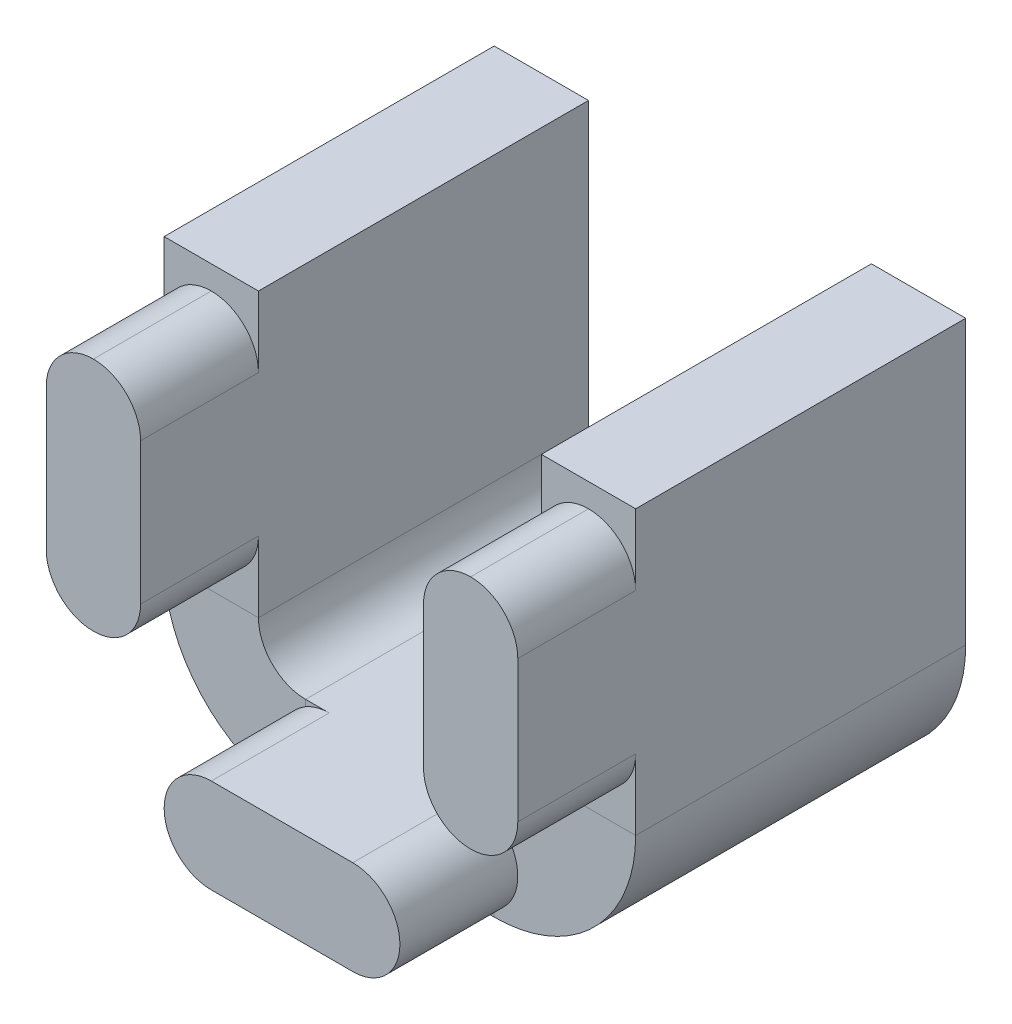
ISO-10303-21;
HEADER;
FILE_DESCRIPTION(('STEP AP214'),'2;1');
FILE_NAME('part.step','',(''),(''),'','','');
FILE_SCHEMA(('AUTOMOTIVE_DESIGN { 1 0 10303 214 1 1 1 1 }'));
ENDSEC;
DATA;
#1=APPLICATION_CONTEXT('core data for automotive mechanical design processes');
#2=APPLICATION_PROTOCOL_DEFINITION('international standard','automotive_design',2000,#1);
#3=PRODUCT_CONTEXT('',#1,'mechanical');
#4=PRODUCT('Part','Part','',(#3));
#5=PRODUCT_RELATED_PRODUCT_CATEGORY('part','',(#4));
#6=PRODUCT_DEFINITION_FORMATION('','',#4);
#7=PRODUCT_DEFINITION_CONTEXT('part definition',#1,'design');
#8=PRODUCT_DEFINITION('design','',#6,#7);
#9=PRODUCT_DEFINITION_SHAPE('','',#8);
#10=(LENGTH_UNIT() NAMED_UNIT(*) SI_UNIT(.MILLI.,.METRE.));
#11=(NAMED_UNIT(*) PLANE_ANGLE_UNIT() SI_UNIT($,.RADIAN.));
#12=(NAMED_UNIT(*) SI_UNIT($,.STERADIAN.) SOLID_ANGLE_UNIT());
#13=UNCERTAINTY_MEASURE_WITH_UNIT(LENGTH_MEASURE(1.E-05),#10,'distance_accuracy_value','');
#14=(GEOMETRIC_REPRESENTATION_CONTEXT(3) GLOBAL_UNCERTAINTY_ASSIGNED_CONTEXT((#13)) GLOBAL_UNIT_ASSIGNED_CONTEXT((#10,
#11,#12)) REPRESENTATION_CONTEXT('',''));
#15=CARTESIAN_POINT('',(0.,0.,0.));
#16=DIRECTION('',(0.,0.,1.));
#17=DIRECTION('',(1.,0.,0.));
#18=AXIS2_PLACEMENT_3D('',#15,#16,#17);
#19=CARTESIAN_POINT('',(-3.,0.,3.5));
#20=DIRECTION('',(0.,-1.,0.));
#21=DIRECTION('',(0.,0.,-1.));
#22=AXIS2_PLACEMENT_3D('',#19,#20,#21);
#23=PLANE('',#22);
#24=DIRECTION('',(0.,0.,-1.));
#25=VECTOR('',#24,1.);
#26=CARTESIAN_POINT('',(-2.00000000000002,0.,-3.5));
#27=LINE('',#26,#25);
#28=CARTESIAN_POINT('',(-2.00000000000002,0.,3.5));
#29=VERTEX_POINT('',#28);
#30=CARTESIAN_POINT('',(-2.00000000000002,0.,-3.5));
#31=VERTEX_POINT('',#30);
#32=EDGE_CURVE('E331',#29,#31,#27,.T.);
#33=ORIENTED_EDGE('',*,*,#32,.F.);
#34=DIRECTION('',(-1.,0.,0.));
#35=VECTOR('',#34,1.);
#36=CARTESIAN_POINT('',(-3.,0.,3.5));
#37=LINE('',#36,#35);
#38=CARTESIAN_POINT('',(-1.5,0.,3.5));
#39=VERTEX_POINT('',#38);
#40=EDGE_CURVE('E327',#39,#29,#37,.T.);
#41=ORIENTED_EDGE('',*,*,#40,.F.);
#42=DIRECTION('',(0.,0.,-1.));
#43=VECTOR('',#42,1.);
#44=CARTESIAN_POINT('',(-1.5,0.,6.));
#45=LINE('',#44,#43);
#46=CARTESIAN_POINT('',(-1.5,0.,6.));
#47=VERTEX_POINT('',#46);
#48=EDGE_CURVE('E665',#47,#39,#45,.T.);
#49=ORIENTED_EDGE('',*,*,#48,.F.);
#50=DIRECTION('',(-1.,0.,0.));
#51=VECTOR('',#50,1.);
#52=CARTESIAN_POINT('',(1.5,0.,6.));
#53=LINE('',#52,#51);
#54=CARTESIAN_POINT('',(1.5,0.,6.));
#55=VERTEX_POINT('',#54);
#56=EDGE_CURVE('E260',#55,#47,#53,.T.);
#57=ORIENTED_EDGE('',*,*,#56,.F.);
#58=DIRECTION('',(0.,0.,-1.));
#59=VECTOR('',#58,1.);
#60=CARTESIAN_POINT('',(1.5,0.,6.));
#61=LINE('',#60,#59);
#62=CARTESIAN_POINT('',(1.5,0.,3.5));
#63=VERTEX_POINT('',#62);
#64=EDGE_CURVE('E272',#55,#63,#61,.T.);
#65=ORIENTED_EDGE('',*,*,#64,.T.);
#66=CARTESIAN_POINT('',(2.00000000000002,0.,3.5));
#67=VERTEX_POINT('',#66);
#68=EDGE_CURVE('E328',#67,#63,#37,.T.);
#69=ORIENTED_EDGE('',*,*,#68,.F.);
#70=DIRECTION('',(0.,0.,1.));
#71=VECTOR('',#70,1.);
#72=CARTESIAN_POINT('',(2.00000000000002,0.,3.5));
#73=LINE('',#72,#71);
#74=CARTESIAN_POINT('',(2.00000000000002,0.,-3.5));
#75=VERTEX_POINT('',#74);
#76=EDGE_CURVE('E347',#75,#67,#73,.T.);
#77=ORIENTED_EDGE('',*,*,#76,.F.);
#78=DIRECTION('',(-1.,0.,0.));
#79=VECTOR('',#78,1.);
#80=CARTESIAN_POINT('',(-3.,0.,-3.5));
#81=LINE('',#80,#79);
#82=EDGE_CURVE('E324',#75,#31,#81,.T.);
#83=ORIENTED_EDGE('',*,*,#82,.T.);
#84=EDGE_LOOP('',(#33,#41,#49,#57,#65,#69,#77,#83));
#85=FACE_BOUND('',#84,.T.);
#86=CARTESIAN_POINT('',(0.,0.,0.));
#87=DIRECTION('',(0.,-1.,0.));
#88=DIRECTION('',(0.,0.,-1.));
#89=AXIS2_PLACEMENT_3D('',#86,#87,#88);
#90=CIRCLE('',#89,1.75);
#91=CARTESIAN_POINT('',(0.,0.,-1.75));
#92=VERTEX_POINT('',#91);
#93=EDGE_CURVE('E12',#92,#92,#90,.F.);
#94=ORIENTED_EDGE('',*,*,#93,.F.);
#95=EDGE_LOOP('',(#94));
#96=FACE_BOUND('',#95,.T.);
#97=ADVANCED_FACE('F44',(#85,#96),#23,.F.);
#98=CARTESIAN_POINT('',(-3.,16.1245154965971,3.5));
#99=DIRECTION('',(0.,0.,1.));
#100=DIRECTION('',(1.,0.,0.));
#101=AXIS2_PLACEMENT_3D('',#98,#99,#100);
#102=PLANE('',#101);
#103=DIRECTION('',(1.,0.,0.));
#104=VECTOR('',#103,1.);
#105=CARTESIAN_POINT('',(-3.,-2.,3.5));
#106=LINE('',#105,#104);
#107=CARTESIAN_POINT('',(-1.5,-2.,3.5));
#108=VERTEX_POINT('',#107);
#109=CARTESIAN_POINT('',(-2.00000000000002,-2.,3.5));
#110=VERTEX_POINT('',#109);
#111=EDGE_CURVE('E318',#108,#110,#106,.F.);
#112=ORIENTED_EDGE('',*,*,#111,.F.);
#113=CARTESIAN_POINT('',(-1.5,-1.,3.5));
#114=DIRECTION('',(0.,0.,1.));
#115=DIRECTION('',(-1.,0.,0.));
#116=AXIS2_PLACEMENT_3D('',#113,#114,#115);
#117=CIRCLE('',#116,1.);
#118=CARTESIAN_POINT('',(-2.00000000000002,-1.86602540378443,3.5));
#119=VERTEX_POINT('',#118);
#120=EDGE_CURVE('E266',#119,#108,#117,.T.);
#121=ORIENTED_EDGE('',*,*,#120,.F.);
#122=DIRECTION('',(0.,-1.,0.));
#123=VECTOR('',#122,1.);
#124=CARTESIAN_POINT('',(-2.00000000000002,16.1245154965971,3.5));
#125=LINE('',#124,#123);
#126=EDGE_CURVE('E341',#119,#110,#125,.T.);
#127=ORIENTED_EDGE('',*,*,#126,.T.);
#128=EDGE_LOOP('',(#112,#121,#127));
#129=FACE_BOUND('',#128,.T.);
#130=ADVANCED_FACE('F566',(#129),#102,.T.);
#131=CARTESIAN_POINT('',(-2.00000000000002,-0.133974596215571,3.5));
#132=VERTEX_POINT('',#131);
#133=EDGE_CURVE('E342',#29,#132,#125,.T.);
#134=ORIENTED_EDGE('',*,*,#133,.T.);
#135=EDGE_CURVE('E60',#39,#132,#117,.T.);
#136=ORIENTED_EDGE('',*,*,#135,.F.);
#137=ORIENTED_EDGE('',*,*,#40,.T.);
#138=EDGE_LOOP('',(#134,#136,#137));
#139=FACE_BOUND('',#138,.T.);
#140=ADVANCED_FACE('F571',(#139),#102,.T.);
#141=DIRECTION('',(0.,-1.,0.));
#142=VECTOR('',#141,1.);
#143=CARTESIAN_POINT('',(2.00000000000002,16.1245154965971,3.5));
#144=LINE('',#143,#142);
#145=CARTESIAN_POINT('',(2.00000000000002,-1.86602540378443,3.5));
#146=VERTEX_POINT('',#145);
#147=CARTESIAN_POINT('',(2.00000000000002,-2.,3.5));
#148=VERTEX_POINT('',#147);
#149=EDGE_CURVE('E337',#146,#148,#144,.T.);
#150=ORIENTED_EDGE('',*,*,#149,.F.);
#151=CARTESIAN_POINT('',(1.5,-1.,3.5));
#152=DIRECTION('',(0.,0.,1.));
#153=DIRECTION('',(1.,0.,0.));
#154=AXIS2_PLACEMENT_3D('',#151,#152,#153);
#155=CIRCLE('',#154,1.);
#156=CARTESIAN_POINT('',(1.5,-2.,3.5));
#157=VERTEX_POINT('',#156);
#158=EDGE_CURVE('E262',#157,#146,#155,.T.);
#159=ORIENTED_EDGE('',*,*,#158,.F.);
#160=EDGE_CURVE('E319',#148,#157,#106,.F.);
#161=ORIENTED_EDGE('',*,*,#160,.F.);
#162=EDGE_LOOP('',(#150,#159,#161));
#163=FACE_BOUND('',#162,.T.);
#164=ADVANCED_FACE('F492',(#163),#102,.T.);
#165=ORIENTED_EDGE('',*,*,#68,.T.);
#166=CARTESIAN_POINT('',(2.00000000000002,-0.133974596215571,3.5));
#167=VERTEX_POINT('',#166);
#168=EDGE_CURVE('E670',#167,#63,#155,.T.);
#169=ORIENTED_EDGE('',*,*,#168,.F.);
#170=EDGE_CURVE('E338',#67,#167,#144,.T.);
#171=ORIENTED_EDGE('',*,*,#170,.F.);
#172=EDGE_LOOP('',(#165,#169,#171));
#173=FACE_BOUND('',#172,.T.);
#174=ADVANCED_FACE('F574',(#173),#102,.T.);
#175=CARTESIAN_POINT('',(2.00000000000002,0.999999999999983,3.5));
#176=DIRECTION('',(0.,0.,1.));
#177=DIRECTION('',(1.,0.,0.));
#178=AXIS2_PLACEMENT_3D('',#175,#176,#177);
#179=PLANE('',#178);
#180=ORIENTED_EDGE('',*,*,#170,.T.);
#181=CARTESIAN_POINT('',(1.5,-1.,3.5));
#182=DIRECTION('',(0.,0.,1.));
#183=DIRECTION('',(1.,0.,0.));
#184=AXIS2_PLACEMENT_3D('',#181,#182,#183);
#185=CIRCLE('',#184,1.);
#186=EDGE_CURVE('E53',#167,#146,#185,.F.);
#187=ORIENTED_EDGE('',*,*,#186,.T.);
#188=ORIENTED_EDGE('',*,*,#149,.T.);
#189=CARTESIAN_POINT('',(2.00000000000002,0.999999999999983,3.5));
#190=DIRECTION('',(0.,0.,-1.));
#191=DIRECTION('',(-1.,0.,0.));
#192=AXIS2_PLACEMENT_3D('',#189,#190,#191);
#193=CIRCLE('',#192,2.99999999999998);
#194=CARTESIAN_POINT('',(5.,0.999999999999984,3.5));
#195=VERTEX_POINT('',#194);
#196=EDGE_CURVE('E305',#195,#148,#193,.T.);
#197=ORIENTED_EDGE('',*,*,#196,.F.);
#198=DIRECTION('',(1.,0.,0.));
#199=VECTOR('',#198,1.);
#200=CARTESIAN_POINT('',(-15.4390889145858,0.999999999999982,3.5));
#201=LINE('',#200,#199);
#202=CARTESIAN_POINT('',(3.,0.999999999999981,3.5));
#203=VERTEX_POINT('',#202);
#204=EDGE_CURVE('E372',#203,#195,#201,.T.);
#205=ORIENTED_EDGE('',*,*,#204,.F.);
#206=CARTESIAN_POINT('',(2.00000000000002,0.999999999999983,3.5));
#207=DIRECTION('',(0.,0.,-1.));
#208=DIRECTION('',(-1.,0.,0.));
#209=AXIS2_PLACEMENT_3D('',#206,#207,#208);
#210=CIRCLE('',#209,0.999999999999983);
#211=EDGE_CURVE('E301',#203,#67,#210,.T.);
#212=ORIENTED_EDGE('',*,*,#211,.T.);
#213=EDGE_LOOP('',(#180,#187,#188,#197,#205,#212));
#214=FACE_BOUND('',#213,.T.);
#215=ADVANCED_FACE('F484',(#214),#179,.T.);
#216=CARTESIAN_POINT('',(-2.00000000000002,0.999999999999983,3.5));
#217=DIRECTION('',(0.,0.,1.));
#218=DIRECTION('',(1.,0.,0.));
#219=AXIS2_PLACEMENT_3D('',#216,#217,#218);
#220=PLANE('',#219);
#221=ORIENTED_EDGE('',*,*,#126,.F.);
#222=CARTESIAN_POINT('',(-1.5,-1.,3.5));
#223=DIRECTION('',(0.,0.,1.));
#224=DIRECTION('',(1.,0.,0.));
#225=AXIS2_PLACEMENT_3D('',#222,#223,#224);
#226=CIRCLE('',#225,1.);
#227=EDGE_CURVE('E478',#119,#132,#226,.F.);
#228=ORIENTED_EDGE('',*,*,#227,.T.);
#229=ORIENTED_EDGE('',*,*,#133,.F.);
#230=CARTESIAN_POINT('',(-2.00000000000002,0.999999999999983,3.5));
#231=DIRECTION('',(0.,0.,1.));
#232=DIRECTION('',(1.,0.,0.));
#233=AXIS2_PLACEMENT_3D('',#230,#231,#232);
#234=CIRCLE('',#233,0.999999999999983);
#235=CARTESIAN_POINT('',(-3.,0.999999999999983,3.5));
#236=VERTEX_POINT('',#235);
#237=EDGE_CURVE('E298',#29,#236,#234,.F.);
#238=ORIENTED_EDGE('',*,*,#237,.T.);
#239=DIRECTION('',(-1.,0.,0.));
#240=VECTOR('',#239,1.);
#241=CARTESIAN_POINT('',(15.4390889145858,0.999999999999982,3.5));
#242=LINE('',#241,#240);
#243=CARTESIAN_POINT('',(-5.,0.999999999999983,3.5));
#244=VERTEX_POINT('',#243);
#245=EDGE_CURVE('E356',#236,#244,#242,.T.);
#246=ORIENTED_EDGE('',*,*,#245,.T.);
#247=CARTESIAN_POINT('',(-2.00000000000002,0.999999999999983,3.5));
#248=DIRECTION('',(0.,0.,1.));
#249=DIRECTION('',(1.,0.,0.));
#250=AXIS2_PLACEMENT_3D('',#247,#248,#249);
#251=CIRCLE('',#250,2.99999999999998);
#252=EDGE_CURVE('E297',#110,#244,#251,.F.);
#253=ORIENTED_EDGE('',*,*,#252,.F.);
#254=EDGE_LOOP('',(#221,#228,#229,#238,#246,#253));
#255=FACE_BOUND('',#254,.T.);
#256=ADVANCED_FACE('F661',(#255),#220,.T.);
#257=CARTESIAN_POINT('',(-15.4390889145858,0.,3.5));
#258=DIRECTION('',(0.,0.,1.));
#259=DIRECTION('',(0.,1.,0.));
#260=AXIS2_PLACEMENT_3D('',#257,#258,#259);
#261=PLANE('',#260);
#262=CARTESIAN_POINT('',(4.,2.5,3.5));
#263=DIRECTION('',(0.,0.,1.));
#264=DIRECTION('',(1.,0.,0.));
#265=AXIS2_PLACEMENT_3D('',#262,#263,#264);
#266=CIRCLE('',#265,1.);
#267=CARTESIAN_POINT('',(5.,2.5,3.5));
#268=VERTEX_POINT('',#267);
#269=CARTESIAN_POINT('',(4.,1.5,3.5));
#270=VERTEX_POINT('',#269);
#271=EDGE_CURVE('E68',#268,#270,#266,.F.);
#272=ORIENTED_EDGE('',*,*,#271,.T.);
#273=CARTESIAN_POINT('',(4.,2.5,3.5));
#274=DIRECTION('',(0.,0.,1.));
#275=DIRECTION('',(1.,0.,0.));
#276=AXIS2_PLACEMENT_3D('',#273,#274,#275);
#277=CIRCLE('',#276,1.);
#278=CARTESIAN_POINT('',(3.,2.5,3.5));
#279=VERTEX_POINT('',#278);
#280=EDGE_CURVE('E473',#270,#279,#277,.F.);
#281=ORIENTED_EDGE('',*,*,#280,.T.);
#282=DIRECTION('',(0.,-1.,0.));
#283=VECTOR('',#282,1.);
#284=CARTESIAN_POINT('',(3.,0.,3.5));
#285=LINE('',#284,#283);
#286=EDGE_CURVE('E371',#279,#203,#285,.T.);
#287=ORIENTED_EDGE('',*,*,#286,.T.);
#288=ORIENTED_EDGE('',*,*,#204,.T.);
#289=DIRECTION('',(0.,1.,0.));
#290=VECTOR('',#289,1.);
#291=CARTESIAN_POINT('',(5.,0.,3.5));
#292=LINE('',#291,#290);
#293=EDGE_CURVE('E368',#268,#195,#292,.F.);
#294=ORIENTED_EDGE('',*,*,#293,.F.);
#295=EDGE_LOOP('',(#272,#281,#287,#288,#294));
#296=FACE_BOUND('',#295,.T.);
#297=ADVANCED_FACE('F521',(#296),#261,.T.);
#298=CARTESIAN_POINT('',(15.4390889145858,0.,3.5));
#299=DIRECTION('',(0.,0.,1.));
#300=DIRECTION('',(0.,-1.,0.));
#301=AXIS2_PLACEMENT_3D('',#298,#299,#300);
#302=PLANE('',#301);
#303=DIRECTION('',(0.,-1.,0.));
#304=VECTOR('',#303,1.);
#305=CARTESIAN_POINT('',(-5.,0.,3.5));
#306=LINE('',#305,#304);
#307=CARTESIAN_POINT('',(-5.,7.,3.5));
#308=VERTEX_POINT('',#307);
#309=CARTESIAN_POINT('',(-5.,5.5,3.5));
#310=VERTEX_POINT('',#309);
#311=EDGE_CURVE('E396',#308,#310,#306,.T.);
#312=ORIENTED_EDGE('',*,*,#311,.T.);
#313=CARTESIAN_POINT('',(-4.,5.5,3.5));
#314=DIRECTION('',(0.,0.,1.));
#315=DIRECTION('',(1.,0.,0.));
#316=AXIS2_PLACEMENT_3D('',#313,#314,#315);
#317=CIRCLE('',#316,1.);
#318=CARTESIAN_POINT('',(-4.,6.5,3.5));
#319=VERTEX_POINT('',#318);
#320=EDGE_CURVE('E446',#310,#319,#317,.F.);
#321=ORIENTED_EDGE('',*,*,#320,.T.);
#322=CARTESIAN_POINT('',(-4.,5.5,3.5));
#323=DIRECTION('',(0.,0.,1.));
#324=DIRECTION('',(1.,0.,0.));
#325=AXIS2_PLACEMENT_3D('',#322,#323,#324);
#326=CIRCLE('',#325,1.);
#327=CARTESIAN_POINT('',(-3.,5.5,3.5));
#328=VERTEX_POINT('',#327);
#329=EDGE_CURVE('E443',#319,#328,#326,.F.);
#330=ORIENTED_EDGE('',*,*,#329,.T.);
#331=DIRECTION('',(0.,-1.,0.));
#332=VECTOR('',#331,1.);
#333=CARTESIAN_POINT('',(-3.,0.,3.5));
#334=LINE('',#333,#332);
#335=CARTESIAN_POINT('',(-3.,7.,3.5));
#336=VERTEX_POINT('',#335);
#337=EDGE_CURVE('E393',#336,#328,#334,.T.);
#338=ORIENTED_EDGE('',*,*,#337,.F.);
#339=DIRECTION('',(-1.,0.,0.));
#340=VECTOR('',#339,1.);
#341=CARTESIAN_POINT('',(15.4390889145858,7.,3.5));
#342=LINE('',#341,#340);
#343=EDGE_CURVE('E399',#336,#308,#342,.T.);
#344=ORIENTED_EDGE('',*,*,#343,.T.);
#345=EDGE_LOOP('',(#312,#321,#330,#338,#344));
#346=FACE_BOUND('',#345,.T.);
#347=ADVANCED_FACE('F609',(#346),#302,.T.);
#348=CARTESIAN_POINT('',(-3.,-2.,3.5));
#349=DIRECTION('',(0.,-1.,0.));
#350=DIRECTION('',(0.,0.,-1.));
#351=AXIS2_PLACEMENT_3D('',#348,#349,#350);
#352=PLANE('',#351);
#353=ORIENTED_EDGE('',*,*,#160,.T.);
#354=DIRECTION('',(0.,0.,-1.));
#355=VECTOR('',#354,1.);
#356=CARTESIAN_POINT('',(1.5,-2.,6.));
#357=LINE('',#356,#355);
#358=CARTESIAN_POINT('',(1.5,-2.,6.));
#359=VERTEX_POINT('',#358);
#360=EDGE_CURVE('E251',#359,#157,#357,.T.);
#361=ORIENTED_EDGE('',*,*,#360,.F.);
#362=DIRECTION('',(1.,0.,0.));
#363=VECTOR('',#362,1.);
#364=CARTESIAN_POINT('',(-1.5,-2.,6.));
#365=LINE('',#364,#363);
#366=CARTESIAN_POINT('',(-1.5,-2.,6.));
#367=VERTEX_POINT('',#366);
#368=EDGE_CURVE('E243',#367,#359,#365,.T.);
#369=ORIENTED_EDGE('',*,*,#368,.F.);
#370=DIRECTION('',(0.,0.,-1.));
#371=VECTOR('',#370,1.);
#372=CARTESIAN_POINT('',(-1.5,-2.,6.));
#373=LINE('',#372,#371);
#374=EDGE_CURVE('E249',#367,#108,#373,.T.);
#375=ORIENTED_EDGE('',*,*,#374,.T.);
#376=ORIENTED_EDGE('',*,*,#111,.T.);
#377=DIRECTION('',(0.,0.,-1.));
#378=VECTOR('',#377,1.);
#379=CARTESIAN_POINT('',(-2.00000000000002,-2.,-3.5));
#380=LINE('',#379,#378);
#381=CARTESIAN_POINT('',(-2.00000000000002,-2.,-3.5));
#382=VERTEX_POINT('',#381);
#383=EDGE_CURVE('E321',#110,#382,#380,.T.);
#384=ORIENTED_EDGE('',*,*,#383,.T.);
#385=DIRECTION('',(1.,0.,0.));
#386=VECTOR('',#385,1.);
#387=CARTESIAN_POINT('',(-3.,-2.,-3.5));
#388=LINE('',#387,#386);
#389=CARTESIAN_POINT('',(2.00000000000002,-2.,-3.5));
#390=VERTEX_POINT('',#389);
#391=EDGE_CURVE('E312',#390,#382,#388,.F.);
#392=ORIENTED_EDGE('',*,*,#391,.F.);
#393=DIRECTION('',(0.,0.,1.));
#394=VECTOR('',#393,1.);
#395=CARTESIAN_POINT('',(2.00000000000002,-2.,3.5));
#396=LINE('',#395,#394);
#397=EDGE_CURVE('E350',#390,#148,#396,.T.);
#398=ORIENTED_EDGE('',*,*,#397,.T.);
#399=EDGE_LOOP('',(#353,#361,#369,#375,#376,#384,#392,#398));
#400=FACE_BOUND('',#399,.T.);
#401=CARTESIAN_POINT('',(0.,-2.,0.));
#402=DIRECTION('',(0.,-1.,0.));
#403=DIRECTION('',(0.,0.,-1.));
#404=AXIS2_PLACEMENT_3D('',#401,#402,#403);
#405=CIRCLE('',#404,1.5);
#406=CARTESIAN_POINT('',(0.,-2.,-1.5));
#407=VERTEX_POINT('',#406);
#408=EDGE_CURVE('E286',#407,#407,#405,.F.);
#409=ORIENTED_EDGE('',*,*,#408,.T.);
#410=EDGE_LOOP('',(#409));
#411=FACE_BOUND('',#410,.T.);
#412=ADVANCED_FACE('F246',(#400,#411),#352,.T.);
#413=CARTESIAN_POINT('',(15.4390889145858,7.,3.5));
#414=DIRECTION('',(0.,1.,0.));
#415=DIRECTION('',(-1.,0.,0.));
#416=AXIS2_PLACEMENT_3D('',#413,#414,#415);
#417=PLANE('',#416);
#418=DIRECTION('',(-1.,0.,0.));
#419=VECTOR('',#418,1.);
#420=CARTESIAN_POINT('',(15.4390889145858,7.,-3.5));
#421=LINE('',#420,#419);
#422=CARTESIAN_POINT('',(-3.,7.,-3.5));
#423=VERTEX_POINT('',#422);
#424=CARTESIAN_POINT('',(-5.,7.,-3.5));
#425=VERTEX_POINT('',#424);
#426=EDGE_CURVE('E411',#423,#425,#421,.T.);
#427=ORIENTED_EDGE('',*,*,#426,.T.);
#428=DIRECTION('',(0.,0.,-1.));
#429=VECTOR('',#428,1.);
#430=CARTESIAN_POINT('',(-5.,7.,3.5));
#431=LINE('',#430,#429);
#432=EDGE_CURVE('E402',#308,#425,#431,.T.);
#433=ORIENTED_EDGE('',*,*,#432,.F.);
#434=ORIENTED_EDGE('',*,*,#343,.F.);
#435=DIRECTION('',(0.,0.,-1.));
#436=VECTOR('',#435,1.);
#437=CARTESIAN_POINT('',(-3.,7.,3.5));
#438=LINE('',#437,#436);
#439=EDGE_CURVE('E409',#336,#423,#438,.T.);
#440=ORIENTED_EDGE('',*,*,#439,.T.);
#441=EDGE_LOOP('',(#427,#433,#434,#440));
#442=FACE_BOUND('',#441,.T.);
#443=ADVANCED_FACE('F593',(#442),#417,.T.);
#444=CARTESIAN_POINT('',(15.4390889145858,0.,-3.5));
#445=DIRECTION('',(0.,0.,1.));
#446=DIRECTION('',(0.,-1.,0.));
#447=AXIS2_PLACEMENT_3D('',#444,#445,#446);
#448=PLANE('',#447);
#449=DIRECTION('',(0.,1.,0.));
#450=VECTOR('',#449,1.);
#451=CARTESIAN_POINT('',(-5.,0.,-3.5));
#452=LINE('',#451,#450);
#453=CARTESIAN_POINT('',(-5.,0.999999999999984,-3.5));
#454=VERTEX_POINT('',#453);
#455=EDGE_CURVE('E406',#454,#425,#452,.T.);
#456=ORIENTED_EDGE('',*,*,#455,.T.);
#457=ORIENTED_EDGE('',*,*,#426,.F.);
#458=DIRECTION('',(0.,1.,0.));
#459=VECTOR('',#458,1.);
#460=CARTESIAN_POINT('',(-3.,0.,-3.5));
#461=LINE('',#460,#459);
#462=CARTESIAN_POINT('',(-3.,0.999999999999982,-3.5));
#463=VERTEX_POINT('',#462);
#464=EDGE_CURVE('E386',#463,#423,#461,.T.);
#465=ORIENTED_EDGE('',*,*,#464,.F.);
#466=DIRECTION('',(-1.,0.,0.));
#467=VECTOR('',#466,1.);
#468=CARTESIAN_POINT('',(15.4390889145858,0.999999999999982,-3.5));
#469=LINE('',#468,#467);
#470=EDGE_CURVE('E404',#463,#454,#469,.T.);
#471=ORIENTED_EDGE('',*,*,#470,.T.);
#472=EDGE_LOOP('',(#456,#457,#465,#471));
#473=FACE_BOUND('',#472,.T.);
#474=ADVANCED_FACE('F596',(#473),#448,.F.);
#475=CARTESIAN_POINT('',(-5.,0.,3.5));
#476=DIRECTION('',(-1.,0.,0.));
#477=DIRECTION('',(0.,0.,1.));
#478=AXIS2_PLACEMENT_3D('',#475,#476,#477);
#479=PLANE('',#478);
#480=CARTESIAN_POINT('',(-5.,2.5,3.5));
#481=VERTEX_POINT('',#480);
#482=EDGE_CURVE('E398',#481,#244,#306,.T.);
#483=ORIENTED_EDGE('',*,*,#482,.F.);
#484=DIRECTION('',(0.,0.,1.));
#485=VECTOR('',#484,1.);
#486=CARTESIAN_POINT('',(-5.,2.5,3.5));
#487=LINE('',#486,#485);
#488=CARTESIAN_POINT('',(-5.,2.5,6.));
#489=VERTEX_POINT('',#488);
#490=EDGE_CURVE('E421',#481,#489,#487,.T.);
#491=ORIENTED_EDGE('',*,*,#490,.T.);
#492=DIRECTION('',(0.,1.,0.));
#493=VECTOR('',#492,1.);
#494=CARTESIAN_POINT('',(-5.,6.5,6.));
#495=LINE('',#494,#493);
#496=CARTESIAN_POINT('',(-5.,5.5,6.));
#497=VERTEX_POINT('',#496);
#498=EDGE_CURVE('E287',#489,#497,#495,.T.);
#499=ORIENTED_EDGE('',*,*,#498,.T.);
#500=DIRECTION('',(0.,0.,-1.));
#501=VECTOR('',#500,1.);
#502=CARTESIAN_POINT('',(-5.,5.5,3.5));
#503=LINE('',#502,#501);
#504=EDGE_CURVE('E389',#497,#310,#503,.T.);
#505=ORIENTED_EDGE('',*,*,#504,.T.);
#506=ORIENTED_EDGE('',*,*,#311,.F.);
#507=ORIENTED_EDGE('',*,*,#432,.T.);
#508=ORIENTED_EDGE('',*,*,#455,.F.);
#509=DIRECTION('',(0.,0.,-1.));
#510=VECTOR('',#509,1.);
#511=CARTESIAN_POINT('',(-5.,0.999999999999982,-3.5));
#512=LINE('',#511,#510);
#513=EDGE_CURVE('E414',#244,#454,#512,.T.);
#514=ORIENTED_EDGE('',*,*,#513,.F.);
#515=EDGE_LOOP('',(#483,#491,#499,#505,#506,#507,#508,#514));
#516=FACE_BOUND('',#515,.T.);
#517=ADVANCED_FACE('F600',(#516),#479,.T.);
#518=CARTESIAN_POINT('',(-3.,2.5,3.5));
#519=VERTEX_POINT('',#518);
#520=EDGE_CURVE('E395',#519,#236,#334,.T.);
#521=ORIENTED_EDGE('',*,*,#520,.F.);
#522=CARTESIAN_POINT('',(-4.,2.5,3.5));
#523=DIRECTION('',(0.,0.,1.));
#524=DIRECTION('',(1.,0.,0.));
#525=AXIS2_PLACEMENT_3D('',#522,#523,#524);
#526=CIRCLE('',#525,1.);
#527=CARTESIAN_POINT('',(-4.,1.5,3.5));
#528=VERTEX_POINT('',#527);
#529=EDGE_CURVE('E441',#519,#528,#526,.F.);
#530=ORIENTED_EDGE('',*,*,#529,.T.);
#531=CARTESIAN_POINT('',(-4.,2.5,3.5));
#532=DIRECTION('',(0.,0.,1.));
#533=DIRECTION('',(1.,0.,0.));
#534=AXIS2_PLACEMENT_3D('',#531,#532,#533);
#535=CIRCLE('',#534,1.);
#536=EDGE_CURVE('E438',#528,#481,#535,.F.);
#537=ORIENTED_EDGE('',*,*,#536,.T.);
#538=ORIENTED_EDGE('',*,*,#482,.T.);
#539=ORIENTED_EDGE('',*,*,#245,.F.);
#540=EDGE_LOOP('',(#521,#530,#537,#538,#539));
#541=FACE_BOUND('',#540,.T.);
#542=ADVANCED_FACE('F604',(#541),#302,.T.);
#543=CARTESIAN_POINT('',(-3.,0.,3.5));
#544=DIRECTION('',(-1.,0.,0.));
#545=DIRECTION('',(0.,0.,1.));
#546=AXIS2_PLACEMENT_3D('',#543,#544,#545);
#547=PLANE('',#546);
#548=DIRECTION('',(0.,1.,0.));
#549=VECTOR('',#548,1.);
#550=CARTESIAN_POINT('',(-3.,6.5,6.));
#551=LINE('',#550,#549);
#552=CARTESIAN_POINT('',(-3.,2.5,6.));
#553=VERTEX_POINT('',#552);
#554=CARTESIAN_POINT('',(-3.,5.5,6.));
#555=VERTEX_POINT('',#554);
#556=EDGE_CURVE('E283',#553,#555,#551,.T.);
#557=ORIENTED_EDGE('',*,*,#556,.F.);
#558=DIRECTION('',(0.,0.,1.));
#559=VECTOR('',#558,1.);
#560=CARTESIAN_POINT('',(-3.,2.5,3.5));
#561=LINE('',#560,#559);
#562=EDGE_CURVE('E435',#553,#519,#561,.F.);
#563=ORIENTED_EDGE('',*,*,#562,.T.);
#564=ORIENTED_EDGE('',*,*,#520,.T.);
#565=DIRECTION('',(0.,0.,-1.));
#566=VECTOR('',#565,1.);
#567=CARTESIAN_POINT('',(-3.,0.999999999999982,-3.5));
#568=LINE('',#567,#566);
#569=EDGE_CURVE('E390',#236,#463,#568,.T.);
#570=ORIENTED_EDGE('',*,*,#569,.T.);
#571=ORIENTED_EDGE('',*,*,#464,.T.);
#572=ORIENTED_EDGE('',*,*,#439,.F.);
#573=ORIENTED_EDGE('',*,*,#337,.T.);
#574=DIRECTION('',(0.,0.,-1.));
#575=VECTOR('',#574,1.);
#576=CARTESIAN_POINT('',(-3.,5.5,6.));
#577=LINE('',#576,#575);
#578=EDGE_CURVE('E432',#328,#555,#577,.F.);
#579=ORIENTED_EDGE('',*,*,#578,.T.);
#580=EDGE_LOOP('',(#557,#563,#564,#570,#571,#572,#573,#579));
#581=FACE_BOUND('',#580,.T.);
#582=ADVANCED_FACE('F582',(#581),#547,.F.);
#583=CARTESIAN_POINT('',(-15.4390889145858,7.,3.5));
#584=DIRECTION('',(0.,-1.,0.));
#585=DIRECTION('',(1.,0.,0.));
#586=AXIS2_PLACEMENT_3D('',#583,#584,#585);
#587=PLANE('',#586);
#588=DIRECTION('',(0.,0.,-1.));
#589=VECTOR('',#588,1.);
#590=CARTESIAN_POINT('',(5.,7.,3.5));
#591=LINE('',#590,#589);
#592=CARTESIAN_POINT('',(5.,7.,3.5));
#593=VERTEX_POINT('',#592);
#594=CARTESIAN_POINT('',(5.,7.,-3.5));
#595=VERTEX_POINT('',#594);
#596=EDGE_CURVE('E378',#593,#595,#591,.T.);
#597=ORIENTED_EDGE('',*,*,#596,.T.);
#598=DIRECTION('',(1.,0.,0.));
#599=VECTOR('',#598,1.);
#600=CARTESIAN_POINT('',(-15.4390889145858,7.,-3.5));
#601=LINE('',#600,#599);
#602=CARTESIAN_POINT('',(3.,7.,-3.5));
#603=VERTEX_POINT('',#602);
#604=EDGE_CURVE('E362',#603,#595,#601,.T.);
#605=ORIENTED_EDGE('',*,*,#604,.F.);
#606=DIRECTION('',(0.,0.,-1.));
#607=VECTOR('',#606,1.);
#608=CARTESIAN_POINT('',(3.,7.,3.5));
#609=LINE('',#608,#607);
#610=CARTESIAN_POINT('',(3.,7.,3.5));
#611=VERTEX_POINT('',#610);
#612=EDGE_CURVE('E354',#611,#603,#609,.T.);
#613=ORIENTED_EDGE('',*,*,#612,.F.);
#614=DIRECTION('',(1.,0.,0.));
#615=VECTOR('',#614,1.);
#616=CARTESIAN_POINT('',(-15.4390889145858,7.,3.5));
#617=LINE('',#616,#615);
#618=EDGE_CURVE('E375',#611,#593,#617,.T.);
#619=ORIENTED_EDGE('',*,*,#618,.T.);
#620=EDGE_LOOP('',(#597,#605,#613,#619));
#621=FACE_BOUND('',#620,.T.);
#622=ADVANCED_FACE('F550',(#621),#587,.F.);
#623=CARTESIAN_POINT('',(4.,5.5,3.5));
#624=DIRECTION('',(0.,0.,1.));
#625=DIRECTION('',(1.,0.,0.));
#626=AXIS2_PLACEMENT_3D('',#623,#624,#625);
#627=CIRCLE('',#626,1.);
#628=CARTESIAN_POINT('',(3.,5.5,3.5));
#629=VERTEX_POINT('',#628);
#630=CARTESIAN_POINT('',(4.,6.5,3.5));
#631=VERTEX_POINT('',#630);
#632=EDGE_CURVE('E470',#629,#631,#627,.F.);
#633=ORIENTED_EDGE('',*,*,#632,.T.);
#634=CARTESIAN_POINT('',(4.,5.5,3.5));
#635=DIRECTION('',(0.,0.,1.));
#636=DIRECTION('',(1.,0.,0.));
#637=AXIS2_PLACEMENT_3D('',#634,#635,#636);
#638=CIRCLE('',#637,1.);
#639=CARTESIAN_POINT('',(5.,5.5,3.5));
#640=VERTEX_POINT('',#639);
#641=EDGE_CURVE('E475',#631,#640,#638,.F.);
#642=ORIENTED_EDGE('',*,*,#641,.T.);
#643=EDGE_CURVE('E366',#593,#640,#292,.F.);
#644=ORIENTED_EDGE('',*,*,#643,.F.);
#645=ORIENTED_EDGE('',*,*,#618,.F.);
#646=EDGE_CURVE('E369',#611,#629,#285,.T.);
#647=ORIENTED_EDGE('',*,*,#646,.T.);
#648=EDGE_LOOP('',(#633,#642,#644,#645,#647));
#649=FACE_BOUND('',#648,.T.);
#650=ADVANCED_FACE('F551',(#649),#261,.T.);
#651=CARTESIAN_POINT('',(5.,0.,3.5));
#652=DIRECTION('',(1.,0.,0.));
#653=DIRECTION('',(0.,0.,-1.));
#654=AXIS2_PLACEMENT_3D('',#651,#652,#653);
#655=PLANE('',#654);
#656=DIRECTION('',(0.,-1.,0.));
#657=VECTOR('',#656,1.);
#658=CARTESIAN_POINT('',(5.,6.5,6.));
#659=LINE('',#658,#657);
#660=CARTESIAN_POINT('',(5.,5.5,6.));
#661=VERTEX_POINT('',#660);
#662=CARTESIAN_POINT('',(5.,2.5,6.));
#663=VERTEX_POINT('',#662);
#664=EDGE_CURVE('E280',#661,#663,#659,.T.);
#665=ORIENTED_EDGE('',*,*,#664,.T.);
#666=DIRECTION('',(0.,0.,-1.));
#667=VECTOR('',#666,1.);
#668=CARTESIAN_POINT('',(5.,2.5,3.5));
#669=LINE('',#668,#667);
#670=EDGE_CURVE('E467',#663,#268,#669,.T.);
#671=ORIENTED_EDGE('',*,*,#670,.T.);
#672=ORIENTED_EDGE('',*,*,#293,.T.);
#673=DIRECTION('',(0.,0.,1.));
#674=VECTOR('',#673,1.);
#675=CARTESIAN_POINT('',(5.,0.999999999999982,3.5));
#676=LINE('',#675,#674);
#677=CARTESIAN_POINT('',(5.,0.999999999999983,-3.5));
#678=VERTEX_POINT('',#677);
#679=EDGE_CURVE('E381',#678,#195,#676,.T.);
#680=ORIENTED_EDGE('',*,*,#679,.F.);
#681=DIRECTION('',(0.,1.,0.));
#682=VECTOR('',#681,1.);
#683=CARTESIAN_POINT('',(5.,0.,-3.5));
#684=LINE('',#683,#682);
#685=EDGE_CURVE('E364',#595,#678,#684,.F.);
#686=ORIENTED_EDGE('',*,*,#685,.F.);
#687=ORIENTED_EDGE('',*,*,#596,.F.);
#688=ORIENTED_EDGE('',*,*,#643,.T.);
#689=DIRECTION('',(0.,0.,1.));
#690=VECTOR('',#689,1.);
#691=CARTESIAN_POINT('',(5.,5.5,3.5));
#692=LINE('',#691,#690);
#693=EDGE_CURVE('E465',#640,#661,#692,.T.);
#694=ORIENTED_EDGE('',*,*,#693,.T.);
#695=EDGE_LOOP('',(#665,#671,#672,#680,#686,#687,#688,#694));
#696=FACE_BOUND('',#695,.T.);
#697=ADVANCED_FACE('F525',(#696),#655,.T.);
#698=CARTESIAN_POINT('',(-15.4390889145858,0.,-3.5));
#699=DIRECTION('',(0.,0.,1.));
#700=DIRECTION('',(0.,1.,0.));
#701=AXIS2_PLACEMENT_3D('',#698,#699,#700);
#702=PLANE('',#701);
#703=ORIENTED_EDGE('',*,*,#685,.T.);
#704=DIRECTION('',(1.,0.,0.));
#705=VECTOR('',#704,1.);
#706=CARTESIAN_POINT('',(-15.4390889145858,0.999999999999982,-3.5));
#707=LINE('',#706,#705);
#708=CARTESIAN_POINT('',(3.,0.999999999999983,-3.5));
#709=VERTEX_POINT('',#708);
#710=EDGE_CURVE('E353',#709,#678,#707,.T.);
#711=ORIENTED_EDGE('',*,*,#710,.F.);
#712=DIRECTION('',(0.,-1.,0.));
#713=VECTOR('',#712,1.);
#714=CARTESIAN_POINT('',(3.,0.,-3.5));
#715=LINE('',#714,#713);
#716=EDGE_CURVE('E360',#603,#709,#715,.T.);
#717=ORIENTED_EDGE('',*,*,#716,.F.);
#718=ORIENTED_EDGE('',*,*,#604,.T.);
#719=EDGE_LOOP('',(#703,#711,#717,#718));
#720=FACE_BOUND('',#719,.T.);
#721=ADVANCED_FACE('F587',(#720),#702,.F.);
#722=CARTESIAN_POINT('',(3.,0.,3.5));
#723=DIRECTION('',(1.,0.,0.));
#724=DIRECTION('',(0.,0.,-1.));
#725=AXIS2_PLACEMENT_3D('',#722,#723,#724);
#726=PLANE('',#725);
#727=DIRECTION('',(0.,-1.,0.));
#728=VECTOR('',#727,1.);
#729=CARTESIAN_POINT('',(3.,6.5,6.));
#730=LINE('',#729,#728);
#731=CARTESIAN_POINT('',(3.,5.5,6.));
#732=VERTEX_POINT('',#731);
#733=CARTESIAN_POINT('',(3.,2.5,6.));
#734=VERTEX_POINT('',#733);
#735=EDGE_CURVE('E276',#732,#734,#730,.T.);
#736=ORIENTED_EDGE('',*,*,#735,.F.);
#737=DIRECTION('',(0.,0.,1.));
#738=VECTOR('',#737,1.);
#739=CARTESIAN_POINT('',(3.,5.5,3.5));
#740=LINE('',#739,#738);
#741=EDGE_CURVE('E462',#732,#629,#740,.F.);
#742=ORIENTED_EDGE('',*,*,#741,.T.);
#743=ORIENTED_EDGE('',*,*,#646,.F.);
#744=ORIENTED_EDGE('',*,*,#612,.T.);
#745=ORIENTED_EDGE('',*,*,#716,.T.);
#746=DIRECTION('',(0.,0.,1.));
#747=VECTOR('',#746,1.);
#748=CARTESIAN_POINT('',(3.,0.999999999999982,3.5));
#749=LINE('',#748,#747);
#750=EDGE_CURVE('E357',#709,#203,#749,.T.);
#751=ORIENTED_EDGE('',*,*,#750,.T.);
#752=ORIENTED_EDGE('',*,*,#286,.F.);
#753=DIRECTION('',(0.,0.,-1.));
#754=VECTOR('',#753,1.);
#755=CARTESIAN_POINT('',(3.,2.5,6.));
#756=LINE('',#755,#754);
#757=EDGE_CURVE('E460',#279,#734,#756,.F.);
#758=ORIENTED_EDGE('',*,*,#757,.T.);
#759=EDGE_LOOP('',(#736,#742,#743,#744,#745,#751,#752,#758));
#760=FACE_BOUND('',#759,.T.);
#761=ADVANCED_FACE('F519',(#760),#726,.F.);
#762=CARTESIAN_POINT('',(-3.,16.1245154965971,-3.5));
#763=DIRECTION('',(0.,0.,1.));
#764=DIRECTION('',(1.,0.,0.));
#765=AXIS2_PLACEMENT_3D('',#762,#763,#764);
#766=PLANE('',#765);
#767=ORIENTED_EDGE('',*,*,#391,.T.);
#768=DIRECTION('',(0.,-1.,0.));
#769=VECTOR('',#768,1.);
#770=CARTESIAN_POINT('',(-2.00000000000002,16.1245154965971,-3.5));
#771=LINE('',#770,#769);
#772=EDGE_CURVE('E345',#31,#382,#771,.T.);
#773=ORIENTED_EDGE('',*,*,#772,.F.);
#774=ORIENTED_EDGE('',*,*,#82,.F.);
#775=DIRECTION('',(0.,-1.,0.));
#776=VECTOR('',#775,1.);
#777=CARTESIAN_POINT('',(2.00000000000002,16.1245154965971,-3.5));
#778=LINE('',#777,#776);
#779=EDGE_CURVE('E334',#75,#390,#778,.T.);
#780=ORIENTED_EDGE('',*,*,#779,.T.);
#781=EDGE_LOOP('',(#767,#773,#774,#780));
#782=FACE_BOUND('',#781,.T.);
#783=ADVANCED_FACE('F503',(#782),#766,.F.);
#784=CARTESIAN_POINT('',(2.00000000000002,0.999999999999983,-3.5));
#785=DIRECTION('',(0.,0.,-1.));
#786=DIRECTION('',(-1.,0.,0.));
#787=AXIS2_PLACEMENT_3D('',#784,#785,#786);
#788=PLANE('',#787);
#789=CARTESIAN_POINT('',(2.00000000000002,0.999999999999983,-3.5));
#790=DIRECTION('',(0.,0.,-1.));
#791=DIRECTION('',(-1.,0.,0.));
#792=AXIS2_PLACEMENT_3D('',#789,#790,#791);
#793=CIRCLE('',#792,0.999999999999983);
#794=EDGE_CURVE('E309',#75,#709,#793,.F.);
#795=ORIENTED_EDGE('',*,*,#794,.T.);
#796=ORIENTED_EDGE('',*,*,#710,.T.);
#797=CARTESIAN_POINT('',(2.00000000000002,0.999999999999983,-3.5));
#798=DIRECTION('',(0.,0.,-1.));
#799=DIRECTION('',(-1.,0.,0.));
#800=AXIS2_PLACEMENT_3D('',#797,#798,#799);
#801=CIRCLE('',#800,2.99999999999998);
#802=EDGE_CURVE('E308',#390,#678,#801,.F.);
#803=ORIENTED_EDGE('',*,*,#802,.F.);
#804=ORIENTED_EDGE('',*,*,#779,.F.);
#805=EDGE_LOOP('',(#795,#796,#803,#804));
#806=FACE_BOUND('',#805,.T.);
#807=ADVANCED_FACE('F498',(#806),#788,.T.);
#808=CARTESIAN_POINT('',(2.00000000000002,0.999999999999983,26.9422769251219));
#809=DIRECTION('',(0.,0.,-1.));
#810=DIRECTION('',(-1.,0.,0.));
#811=AXIS2_PLACEMENT_3D('',#808,#809,#810);
#812=CYLINDRICAL_SURFACE('',#811,2.99999999999998);
#813=ORIENTED_EDGE('',*,*,#397,.F.);
#814=ORIENTED_EDGE('',*,*,#802,.T.);
#815=ORIENTED_EDGE('',*,*,#679,.T.);
#816=ORIENTED_EDGE('',*,*,#196,.T.);
#817=EDGE_LOOP('',(#813,#814,#815,#816));
#818=FACE_BOUND('',#817,.T.);
#819=ADVANCED_FACE('F496',(#818),#812,.T.);
#820=CARTESIAN_POINT('',(2.00000000000002,0.999999999999983,26.9422769251219));
#821=DIRECTION('',(0.,0.,-1.));
#822=DIRECTION('',(-1.,0.,0.));
#823=AXIS2_PLACEMENT_3D('',#820,#821,#822);
#824=CYLINDRICAL_SURFACE('',#823,0.999999999999983);
#825=ORIENTED_EDGE('',*,*,#76,.T.);
#826=ORIENTED_EDGE('',*,*,#211,.F.);
#827=ORIENTED_EDGE('',*,*,#750,.F.);
#828=ORIENTED_EDGE('',*,*,#794,.F.);
#829=EDGE_LOOP('',(#825,#826,#827,#828));
#830=FACE_BOUND('',#829,.T.);
#831=ADVANCED_FACE('F514',(#830),#824,.F.);
#832=CARTESIAN_POINT('',(-2.00000000000002,0.999999999999983,-3.5));
#833=DIRECTION('',(0.,0.,-1.));
#834=DIRECTION('',(-1.,0.,0.));
#835=AXIS2_PLACEMENT_3D('',#832,#833,#834);
#836=PLANE('',#835);
#837=ORIENTED_EDGE('',*,*,#470,.F.);
#838=CARTESIAN_POINT('',(-2.00000000000002,0.999999999999983,-3.5));
#839=DIRECTION('',(0.,0.,1.));
#840=DIRECTION('',(1.,0.,0.));
#841=AXIS2_PLACEMENT_3D('',#838,#839,#840);
#842=CIRCLE('',#841,0.999999999999983);
#843=EDGE_CURVE('E293',#463,#31,#842,.T.);
#844=ORIENTED_EDGE('',*,*,#843,.T.);
#845=ORIENTED_EDGE('',*,*,#772,.T.);
#846=CARTESIAN_POINT('',(-2.00000000000002,0.999999999999983,-3.5));
#847=DIRECTION('',(0.,0.,1.));
#848=DIRECTION('',(1.,0.,0.));
#849=AXIS2_PLACEMENT_3D('',#846,#847,#848);
#850=CIRCLE('',#849,2.99999999999998);
#851=EDGE_CURVE('E294',#454,#382,#850,.T.);
#852=ORIENTED_EDGE('',*,*,#851,.F.);
#853=EDGE_LOOP('',(#837,#844,#845,#852));
#854=FACE_BOUND('',#853,.T.);
#855=ADVANCED_FACE('F653',(#854),#836,.T.);
#856=CARTESIAN_POINT('',(-2.00000000000002,0.999999999999983,-23.2623635578952));
#857=DIRECTION('',(0.,0.,1.));
#858=DIRECTION('',(1.,0.,0.));
#859=AXIS2_PLACEMENT_3D('',#856,#857,#858);
#860=CYLINDRICAL_SURFACE('',#859,2.99999999999998);
#861=ORIENTED_EDGE('',*,*,#383,.F.);
#862=ORIENTED_EDGE('',*,*,#252,.T.);
#863=ORIENTED_EDGE('',*,*,#513,.T.);
#864=ORIENTED_EDGE('',*,*,#851,.T.);
#865=EDGE_LOOP('',(#861,#862,#863,#864));
#866=FACE_BOUND('',#865,.T.);
#867=ADVANCED_FACE('F705',(#866),#860,.T.);
#868=CARTESIAN_POINT('',(-2.00000000000002,0.999999999999983,-23.2623635578952));
#869=DIRECTION('',(0.,0.,1.));
#870=DIRECTION('',(1.,0.,0.));
#871=AXIS2_PLACEMENT_3D('',#868,#869,#870);
#872=CYLINDRICAL_SURFACE('',#871,0.999999999999983);
#873=ORIENTED_EDGE('',*,*,#32,.T.);
#874=ORIENTED_EDGE('',*,*,#843,.F.);
#875=ORIENTED_EDGE('',*,*,#569,.F.);
#876=ORIENTED_EDGE('',*,*,#237,.F.);
#877=EDGE_LOOP('',(#873,#874,#875,#876));
#878=FACE_BOUND('',#877,.T.);
#879=ADVANCED_FACE('F656',(#878),#872,.F.);
#880=CARTESIAN_POINT('',(0.,-2.,0.));
#881=DIRECTION('',(0.,-1.,0.));
#882=DIRECTION('',(0.,0.,-1.));
#883=AXIS2_PLACEMENT_3D('',#880,#881,#882);
#884=CYLINDRICAL_SURFACE('',#883,1.5);
#885=ORIENTED_EDGE('',*,*,#408,.F.);
#886=EDGE_LOOP('',(#885));
#887=FACE_BOUND('',#886,.T.);
#888=CARTESIAN_POINT('',(0.,1.,0.));
#889=DIRECTION('',(0.,1.,0.));
#890=DIRECTION('',(0.,0.,1.));
#891=AXIS2_PLACEMENT_3D('',#888,#889,#890);
#892=CIRCLE('',#891,1.5);
#893=CARTESIAN_POINT('',(0.,1.,1.5));
#894=VERTEX_POINT('',#893);
#895=EDGE_CURVE('E676',#894,#894,#892,.T.);
#896=ORIENTED_EDGE('',*,*,#895,.T.);
#897=EDGE_LOOP('',(#896));
#898=FACE_BOUND('',#897,.T.);
#899=ADVANCED_FACE('F680',(#887,#898),#884,.F.);
#900=CARTESIAN_POINT('',(-3.,6.5,6.));
#901=DIRECTION('',(0.,0.,1.));
#902=DIRECTION('',(0.,-1.,0.));
#903=AXIS2_PLACEMENT_3D('',#900,#901,#902);
#904=PLANE('',#903);
#905=ORIENTED_EDGE('',*,*,#498,.F.);
#906=CARTESIAN_POINT('',(-4.,2.5,6.));
#907=DIRECTION('',(0.,0.,1.));
#908=DIRECTION('',(0.,-1.,0.));
#909=AXIS2_PLACEMENT_3D('',#906,#907,#908);
#910=CIRCLE('',#909,1.);
#911=CARTESIAN_POINT('',(-4.,1.5,6.));
#912=VERTEX_POINT('',#911);
#913=EDGE_CURVE('E430',#489,#912,#910,.T.);
#914=ORIENTED_EDGE('',*,*,#913,.T.);
#915=CARTESIAN_POINT('',(-4.,2.5,6.));
#916=DIRECTION('',(0.,0.,1.));
#917=DIRECTION('',(0.,-1.,0.));
#918=AXIS2_PLACEMENT_3D('',#915,#916,#917);
#919=CIRCLE('',#918,1.);
#920=EDGE_CURVE('E428',#912,#553,#919,.T.);
#921=ORIENTED_EDGE('',*,*,#920,.T.);
#922=ORIENTED_EDGE('',*,*,#556,.T.);
#923=CARTESIAN_POINT('',(-4.,5.5,6.));
#924=DIRECTION('',(0.,0.,1.));
#925=DIRECTION('',(0.,-1.,0.));
#926=AXIS2_PLACEMENT_3D('',#923,#924,#925);
#927=CIRCLE('',#926,1.);
#928=CARTESIAN_POINT('',(-4.,6.5,6.));
#929=VERTEX_POINT('',#928);
#930=EDGE_CURVE('E426',#555,#929,#927,.T.);
#931=ORIENTED_EDGE('',*,*,#930,.T.);
#932=CARTESIAN_POINT('',(-4.,5.5,6.));
#933=DIRECTION('',(0.,0.,1.));
#934=DIRECTION('',(0.,-1.,0.));
#935=AXIS2_PLACEMENT_3D('',#932,#933,#934);
#936=CIRCLE('',#935,1.);
#937=EDGE_CURVE('E424',#929,#497,#936,.T.);
#938=ORIENTED_EDGE('',*,*,#937,.T.);
#939=EDGE_LOOP('',(#905,#914,#921,#922,#931,#938));
#940=FACE_BOUND('',#939,.T.);
#941=ADVANCED_FACE('F621',(#940),#904,.T.);
#942=CARTESIAN_POINT('',(-4.,2.5,3.5));
#943=DIRECTION('',(0.,0.,-1.));
#944=DIRECTION('',(-1.,0.,0.));
#945=AXIS2_PLACEMENT_3D('',#942,#943,#944);
#946=CYLINDRICAL_SURFACE('',#945,1.);
#947=DIRECTION('',(0.,0.,1.));
#948=VECTOR('',#947,1.);
#949=CARTESIAN_POINT('',(-4.,1.5,6.));
#950=LINE('',#949,#948);
#951=EDGE_CURVE('E290',#528,#912,#950,.T.);
#952=ORIENTED_EDGE('',*,*,#951,.F.);
#953=ORIENTED_EDGE('',*,*,#529,.F.);
#954=ORIENTED_EDGE('',*,*,#562,.F.);
#955=ORIENTED_EDGE('',*,*,#920,.F.);
#956=EDGE_LOOP('',(#952,#953,#954,#955));
#957=FACE_BOUND('',#956,.T.);
#958=ADVANCED_FACE('F617',(#957),#946,.T.);
#959=CARTESIAN_POINT('',(-4.,2.5,3.5));
#960=DIRECTION('',(0.,0.,1.));
#961=DIRECTION('',(1.,0.,0.));
#962=AXIS2_PLACEMENT_3D('',#959,#960,#961);
#963=CYLINDRICAL_SURFACE('',#962,1.);
#964=ORIENTED_EDGE('',*,*,#536,.F.);
#965=ORIENTED_EDGE('',*,*,#951,.T.);
#966=ORIENTED_EDGE('',*,*,#913,.F.);
#967=ORIENTED_EDGE('',*,*,#490,.F.);
#968=EDGE_LOOP('',(#964,#965,#966,#967));
#969=FACE_BOUND('',#968,.T.);
#970=ADVANCED_FACE('F613',(#969),#963,.T.);
#971=CARTESIAN_POINT('',(-4.,5.5,3.5));
#972=DIRECTION('',(0.,0.,-1.));
#973=DIRECTION('',(-1.,0.,0.));
#974=AXIS2_PLACEMENT_3D('',#971,#972,#973);
#975=CYLINDRICAL_SURFACE('',#974,1.);
#976=ORIENTED_EDGE('',*,*,#504,.F.);
#977=ORIENTED_EDGE('',*,*,#937,.F.);
#978=DIRECTION('',(0.,0.,-1.));
#979=VECTOR('',#978,1.);
#980=CARTESIAN_POINT('',(-4.,6.5,3.5));
#981=LINE('',#980,#979);
#982=EDGE_CURVE('E279',#319,#929,#981,.F.);
#983=ORIENTED_EDGE('',*,*,#982,.F.);
#984=ORIENTED_EDGE('',*,*,#320,.F.);
#985=EDGE_LOOP('',(#976,#977,#983,#984));
#986=FACE_BOUND('',#985,.T.);
#987=ADVANCED_FACE('F616',(#986),#975,.T.);
#988=CARTESIAN_POINT('',(-4.,5.5,3.5));
#989=DIRECTION('',(0.,0.,1.));
#990=DIRECTION('',(1.,0.,0.));
#991=AXIS2_PLACEMENT_3D('',#988,#989,#990);
#992=CYLINDRICAL_SURFACE('',#991,1.);
#993=ORIENTED_EDGE('',*,*,#930,.F.);
#994=ORIENTED_EDGE('',*,*,#578,.F.);
#995=ORIENTED_EDGE('',*,*,#329,.F.);
#996=ORIENTED_EDGE('',*,*,#982,.T.);
#997=EDGE_LOOP('',(#993,#994,#995,#996));
#998=FACE_BOUND('',#997,.T.);
#999=ADVANCED_FACE('F563',(#998),#992,.T.);
#1000=CARTESIAN_POINT('',(3.,6.5,6.));
#1001=DIRECTION('',(0.,0.,1.));
#1002=DIRECTION('',(1.,0.,0.));
#1003=AXIS2_PLACEMENT_3D('',#1000,#1001,#1002);
#1004=PLANE('',#1003);
#1005=CARTESIAN_POINT('',(4.,2.5,6.));
#1006=DIRECTION('',(0.,0.,1.));
#1007=DIRECTION('',(1.,0.,0.));
#1008=AXIS2_PLACEMENT_3D('',#1005,#1006,#1007);
#1009=CIRCLE('',#1008,1.);
#1010=CARTESIAN_POINT('',(4.,1.5,6.));
#1011=VERTEX_POINT('',#1010);
#1012=EDGE_CURVE('E456',#734,#1011,#1009,.T.);
#1013=ORIENTED_EDGE('',*,*,#1012,.T.);
#1014=CARTESIAN_POINT('',(4.,2.5,6.));
#1015=DIRECTION('',(0.,0.,1.));
#1016=DIRECTION('',(1.,0.,0.));
#1017=AXIS2_PLACEMENT_3D('',#1014,#1015,#1016);
#1018=CIRCLE('',#1017,1.);
#1019=EDGE_CURVE('E458',#1011,#663,#1018,.T.);
#1020=ORIENTED_EDGE('',*,*,#1019,.T.);
#1021=ORIENTED_EDGE('',*,*,#664,.F.);
#1022=CARTESIAN_POINT('',(4.,5.5,6.));
#1023=DIRECTION('',(0.,0.,1.));
#1024=DIRECTION('',(1.,0.,0.));
#1025=AXIS2_PLACEMENT_3D('',#1022,#1023,#1024);
#1026=CIRCLE('',#1025,1.);
#1027=CARTESIAN_POINT('',(4.,6.5,6.));
#1028=VERTEX_POINT('',#1027);
#1029=EDGE_CURVE('E448',#661,#1028,#1026,.T.);
#1030=ORIENTED_EDGE('',*,*,#1029,.T.);
#1031=CARTESIAN_POINT('',(4.,5.5,6.));
#1032=DIRECTION('',(0.,0.,1.));
#1033=DIRECTION('',(1.,0.,0.));
#1034=AXIS2_PLACEMENT_3D('',#1031,#1032,#1033);
#1035=CIRCLE('',#1034,1.);
#1036=EDGE_CURVE('E454',#1028,#732,#1035,.T.);
#1037=ORIENTED_EDGE('',*,*,#1036,.T.);
#1038=ORIENTED_EDGE('',*,*,#735,.T.);
#1039=EDGE_LOOP('',(#1013,#1020,#1021,#1030,#1037,#1038));
#1040=FACE_BOUND('',#1039,.T.);
#1041=ADVANCED_FACE('F538',(#1040),#1004,.T.);
#1042=CARTESIAN_POINT('',(4.,5.5,3.5));
#1043=DIRECTION('',(0.,0.,1.));
#1044=DIRECTION('',(1.,0.,0.));
#1045=AXIS2_PLACEMENT_3D('',#1042,#1043,#1044);
#1046=CYLINDRICAL_SURFACE('',#1045,1.);
#1047=ORIENTED_EDGE('',*,*,#693,.F.);
#1048=ORIENTED_EDGE('',*,*,#641,.F.);
#1049=DIRECTION('',(0.,0.,1.));
#1050=VECTOR('',#1049,1.);
#1051=CARTESIAN_POINT('',(4.,6.5,3.5));
#1052=LINE('',#1051,#1050);
#1053=EDGE_CURVE('E270',#1028,#631,#1052,.F.);
#1054=ORIENTED_EDGE('',*,*,#1053,.F.);
#1055=ORIENTED_EDGE('',*,*,#1029,.F.);
#1056=EDGE_LOOP('',(#1047,#1048,#1054,#1055));
#1057=FACE_BOUND('',#1056,.T.);
#1058=ADVANCED_FACE('F555',(#1057),#1046,.T.);
#1059=CARTESIAN_POINT('',(4.,5.5,3.5));
#1060=DIRECTION('',(0.,0.,-1.));
#1061=DIRECTION('',(-1.,0.,0.));
#1062=AXIS2_PLACEMENT_3D('',#1059,#1060,#1061);
#1063=CYLINDRICAL_SURFACE('',#1062,1.);
#1064=ORIENTED_EDGE('',*,*,#632,.F.);
#1065=ORIENTED_EDGE('',*,*,#741,.F.);
#1066=ORIENTED_EDGE('',*,*,#1036,.F.);
#1067=ORIENTED_EDGE('',*,*,#1053,.T.);
#1068=EDGE_LOOP('',(#1064,#1065,#1066,#1067));
#1069=FACE_BOUND('',#1068,.T.);
#1070=ADVANCED_FACE('F544',(#1069),#1063,.T.);
#1071=CARTESIAN_POINT('',(4.,2.5,3.5));
#1072=DIRECTION('',(0.,0.,1.));
#1073=DIRECTION('',(1.,0.,0.));
#1074=AXIS2_PLACEMENT_3D('',#1071,#1072,#1073);
#1075=CYLINDRICAL_SURFACE('',#1074,1.);
#1076=DIRECTION('',(0.,0.,-1.));
#1077=VECTOR('',#1076,1.);
#1078=CARTESIAN_POINT('',(4.,1.5,3.5));
#1079=LINE('',#1078,#1077);
#1080=EDGE_CURVE('E267',#1011,#270,#1079,.T.);
#1081=ORIENTED_EDGE('',*,*,#1080,.F.);
#1082=ORIENTED_EDGE('',*,*,#1012,.F.);
#1083=ORIENTED_EDGE('',*,*,#757,.F.);
#1084=ORIENTED_EDGE('',*,*,#280,.F.);
#1085=EDGE_LOOP('',(#1081,#1082,#1083,#1084));
#1086=FACE_BOUND('',#1085,.T.);
#1087=ADVANCED_FACE('F46',(#1086),#1075,.T.);
#1088=CARTESIAN_POINT('',(4.,2.5,3.5));
#1089=DIRECTION('',(0.,0.,-1.));
#1090=DIRECTION('',(-1.,0.,0.));
#1091=AXIS2_PLACEMENT_3D('',#1088,#1089,#1090);
#1092=CYLINDRICAL_SURFACE('',#1091,1.);
#1093=ORIENTED_EDGE('',*,*,#1019,.F.);
#1094=ORIENTED_EDGE('',*,*,#1080,.T.);
#1095=ORIENTED_EDGE('',*,*,#271,.F.);
#1096=ORIENTED_EDGE('',*,*,#670,.F.);
#1097=EDGE_LOOP('',(#1093,#1094,#1095,#1096));
#1098=FACE_BOUND('',#1097,.T.);
#1099=ADVANCED_FACE('F531',(#1098),#1092,.T.);
#1100=CARTESIAN_POINT('',(-1.5,-1.,6.));
#1101=DIRECTION('',(0.,0.,-1.));
#1102=DIRECTION('',(-1.,0.,0.));
#1103=AXIS2_PLACEMENT_3D('',#1100,#1101,#1102);
#1104=CYLINDRICAL_SURFACE('',#1103,1.);
#1105=ORIENTED_EDGE('',*,*,#135,.T.);
#1106=ORIENTED_EDGE('',*,*,#227,.F.);
#1107=ORIENTED_EDGE('',*,*,#120,.T.);
#1108=ORIENTED_EDGE('',*,*,#374,.F.);
#1109=CARTESIAN_POINT('',(-1.5,-1.,6.));
#1110=DIRECTION('',(0.,0.,1.));
#1111=DIRECTION('',(-1.,0.,0.));
#1112=AXIS2_PLACEMENT_3D('',#1109,#1110,#1111);
#1113=CIRCLE('',#1112,1.);
#1114=EDGE_CURVE('E255',#47,#367,#1113,.T.);
#1115=ORIENTED_EDGE('',*,*,#1114,.F.);
#1116=ORIENTED_EDGE('',*,*,#48,.T.);
#1117=EDGE_LOOP('',(#1105,#1106,#1107,#1108,#1115,#1116));
#1118=FACE_BOUND('',#1117,.T.);
#1119=ADVANCED_FACE('F264',(#1118),#1104,.T.);
#1120=CARTESIAN_POINT('',(1.5,-1.,6.));
#1121=DIRECTION('',(0.,0.,-1.));
#1122=DIRECTION('',(-1.,0.,0.));
#1123=AXIS2_PLACEMENT_3D('',#1120,#1121,#1122);
#1124=CYLINDRICAL_SURFACE('',#1123,1.);
#1125=ORIENTED_EDGE('',*,*,#158,.T.);
#1126=ORIENTED_EDGE('',*,*,#186,.F.);
#1127=ORIENTED_EDGE('',*,*,#168,.T.);
#1128=ORIENTED_EDGE('',*,*,#64,.F.);
#1129=CARTESIAN_POINT('',(1.5,-1.,6.));
#1130=DIRECTION('',(0.,0.,1.));
#1131=DIRECTION('',(1.,0.,0.));
#1132=AXIS2_PLACEMENT_3D('',#1129,#1130,#1131);
#1133=CIRCLE('',#1132,1.);
#1134=EDGE_CURVE('E254',#359,#55,#1133,.T.);
#1135=ORIENTED_EDGE('',*,*,#1134,.F.);
#1136=ORIENTED_EDGE('',*,*,#360,.T.);
#1137=EDGE_LOOP('',(#1125,#1126,#1127,#1128,#1135,#1136));
#1138=FACE_BOUND('',#1137,.T.);
#1139=ADVANCED_FACE('F693',(#1138),#1124,.T.);
#1140=CARTESIAN_POINT('',(-1.5,-1.,6.));
#1141=DIRECTION('',(0.,0.,-1.));
#1142=DIRECTION('',(-1.,0.,0.));
#1143=AXIS2_PLACEMENT_3D('',#1140,#1141,#1142);
#1144=PLANE('',#1143);
#1145=ORIENTED_EDGE('',*,*,#1114,.T.);
#1146=ORIENTED_EDGE('',*,*,#368,.T.);
#1147=ORIENTED_EDGE('',*,*,#1134,.T.);
#1148=ORIENTED_EDGE('',*,*,#56,.T.);
#1149=EDGE_LOOP('',(#1145,#1146,#1147,#1148));
#1150=FACE_BOUND('',#1149,.T.);
#1151=ADVANCED_FACE('F258',(#1150),#1144,.F.);
#1152=CARTESIAN_POINT('',(0.,1.,0.));
#1153=DIRECTION('',(0.,1.,0.));
#1154=DIRECTION('',(0.,0.,1.));
#1155=AXIS2_PLACEMENT_3D('',#1152,#1153,#1154);
#1156=PLANE('',#1155);
#1157=CARTESIAN_POINT('',(0.,1.,0.));
#1158=DIRECTION('',(0.,1.,0.));
#1159=DIRECTION('',(1.,0.,0.));
#1160=AXIS2_PLACEMENT_3D('',#1157,#1158,#1159);
#1161=CIRCLE('',#1160,1.75);
#1162=CARTESIAN_POINT('',(1.75,1.,0.));
#1163=VERTEX_POINT('',#1162);
#1164=EDGE_CURVE('E673',#1163,#1163,#1161,.T.);
#1165=ORIENTED_EDGE('',*,*,#1164,.T.);
#1166=EDGE_LOOP('',(#1165));
#1167=FACE_BOUND('',#1166,.T.);
#1168=ORIENTED_EDGE('',*,*,#895,.F.);
#1169=EDGE_LOOP('',(#1168));
#1170=FACE_BOUND('',#1169,.T.);
#1171=ADVANCED_FACE('F682',(#1167,#1170),#1156,.T.);
#1172=CARTESIAN_POINT('',(0.,1.,0.));
#1173=DIRECTION('',(0.,-1.,0.));
#1174=DIRECTION('',(0.,0.,-1.));
#1175=AXIS2_PLACEMENT_3D('',#1172,#1173,#1174);
#1176=CYLINDRICAL_SURFACE('',#1175,1.75);
#1177=ORIENTED_EDGE('',*,*,#1164,.F.);
#1178=EDGE_LOOP('',(#1177));
#1179=FACE_BOUND('',#1178,.T.);
#1180=ORIENTED_EDGE('',*,*,#93,.T.);
#1181=EDGE_LOOP('',(#1180));
#1182=FACE_BOUND('',#1181,.T.);
#1183=ADVANCED_FACE('F684',(#1179,#1182),#1176,.T.);
#1184=CLOSED_SHELL('',(#97,#130,#140,#164,#174,#215,#256,#297,#347,#412,#443,#474,#517,#542,
#582,#622,#650,#697,#721,#761,#783,#807,#819,#831,#855,#867,#879,#899,#941,#958,#970,#987,#999,
#1041,#1058,#1070,#1087,#1099,#1119,#1139,#1151,#1171,#1183));
#1185=MANIFOLD_SOLID_BREP('B2',#1184);
#1186=ADVANCED_BREP_SHAPE_REPRESENTATION('',(#18,#1185),#14);
#1187=SHAPE_DEFINITION_REPRESENTATION(#9,#1186);
ENDSEC;
END-ISO-10303-21;
